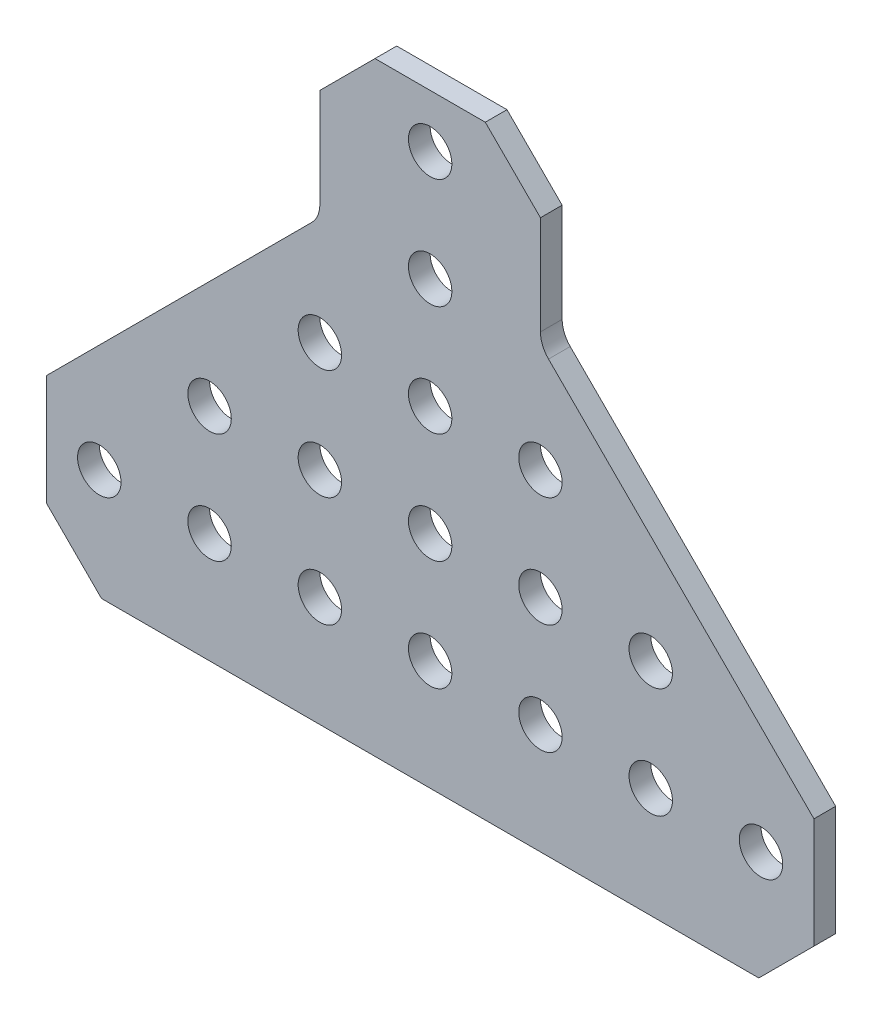
ISO-10303-21;
HEADER;
FILE_DESCRIPTION(('STEP AP214'),'2;1');
FILE_NAME('part.step','',(''),(''),'','','');
FILE_SCHEMA(('AUTOMOTIVE_DESIGN { 1 0 10303 214 1 1 1 1 }'));
ENDSEC;
DATA;
#1=APPLICATION_CONTEXT('core data for automotive mechanical design processes');
#2=APPLICATION_PROTOCOL_DEFINITION('international standard','automotive_design',2000,#1);
#3=PRODUCT_CONTEXT('',#1,'mechanical');
#4=PRODUCT('Part','Part','',(#3));
#5=PRODUCT_RELATED_PRODUCT_CATEGORY('part','',(#4));
#6=PRODUCT_DEFINITION_FORMATION('','',#4);
#7=PRODUCT_DEFINITION_CONTEXT('part definition',#1,'design');
#8=PRODUCT_DEFINITION('design','',#6,#7);
#9=PRODUCT_DEFINITION_SHAPE('','',#8);
#10=(LENGTH_UNIT() NAMED_UNIT(*) SI_UNIT(.MILLI.,.METRE.));
#11=(NAMED_UNIT(*) PLANE_ANGLE_UNIT() SI_UNIT($,.RADIAN.));
#12=(NAMED_UNIT(*) SI_UNIT($,.STERADIAN.) SOLID_ANGLE_UNIT());
#13=UNCERTAINTY_MEASURE_WITH_UNIT(LENGTH_MEASURE(1.E-05),#10,'distance_accuracy_value','');
#14=(GEOMETRIC_REPRESENTATION_CONTEXT(3) GLOBAL_UNCERTAINTY_ASSIGNED_CONTEXT((#13)) GLOBAL_UNIT_ASSIGNED_CONTEXT((#10,
#11,#12)) REPRESENTATION_CONTEXT('',''));
#15=CARTESIAN_POINT('',(0.,0.,0.));
#16=DIRECTION('',(0.,0.,1.));
#17=DIRECTION('',(1.,0.,0.));
#18=AXIS2_PLACEMENT_3D('',#15,#16,#17);
#19=CARTESIAN_POINT('',(-44.196,-6.35,1.25));
#20=DIRECTION('',(-1.,0.,0.));
#21=DIRECTION('',(0.,-1.,0.));
#22=AXIS2_PLACEMENT_3D('',#19,#20,#21);
#23=PLANE('',#22);
#24=DIRECTION('',(0.,1.,0.));
#25=VECTOR('',#24,1.);
#26=CARTESIAN_POINT('',(-44.196,-6.35,-1.25));
#27=LINE('',#26,#25);
#28=CARTESIAN_POINT('',(-44.196,-6.35,-1.25));
#29=VERTEX_POINT('',#28);
#30=CARTESIAN_POINT('',(-44.1960000000002,6.35000000000021,-1.25));
#31=VERTEX_POINT('',#30);
#32=EDGE_CURVE('E172',#29,#31,#27,.T.);
#33=ORIENTED_EDGE('',*,*,#32,.F.);
#34=DIRECTION('',(0.,0.,-1.));
#35=VECTOR('',#34,1.);
#36=CARTESIAN_POINT('',(-44.196,-6.35,1.25));
#37=LINE('',#36,#35);
#38=CARTESIAN_POINT('',(-44.196,-6.35,1.25));
#39=VERTEX_POINT('',#38);
#40=EDGE_CURVE('E11',#39,#29,#37,.T.);
#41=ORIENTED_EDGE('',*,*,#40,.F.);
#42=DIRECTION('',(0.,1.,0.));
#43=VECTOR('',#42,1.);
#44=CARTESIAN_POINT('',(-44.196,-6.35,1.25));
#45=LINE('',#44,#43);
#46=CARTESIAN_POINT('',(-44.1960000000002,6.35000000000021,1.25));
#47=VERTEX_POINT('',#46);
#48=EDGE_CURVE('E211',#39,#47,#45,.T.);
#49=ORIENTED_EDGE('',*,*,#48,.T.);
#50=DIRECTION('',(0.,0.,-1.));
#51=VECTOR('',#50,1.);
#52=CARTESIAN_POINT('',(-44.1960000000002,6.35000000000021,1.25));
#53=LINE('',#52,#51);
#54=EDGE_CURVE('E42',#47,#31,#53,.T.);
#55=ORIENTED_EDGE('',*,*,#54,.T.);
#56=EDGE_LOOP('',(#33,#41,#49,#55));
#57=FACE_BOUND('',#56,.T.);
#58=ADVANCED_FACE('F39',(#57),#23,.T.);
#59=CARTESIAN_POINT('',(-37.846,-12.7,1.25));
#60=DIRECTION('',(-0.707106781186547,-0.707106781186548,0.));
#61=DIRECTION('',(0.707106781186548,-0.707106781186547,0.));
#62=AXIS2_PLACEMENT_3D('',#59,#60,#61);
#63=PLANE('',#62);
#64=DIRECTION('',(-0.707106781186548,0.707106781186547,0.));
#65=VECTOR('',#64,1.);
#66=CARTESIAN_POINT('',(-37.846,-12.7,-1.25));
#67=LINE('',#66,#65);
#68=CARTESIAN_POINT('',(-37.846,-12.7,-1.25));
#69=VERTEX_POINT('',#68);
#70=EDGE_CURVE('E209',#69,#29,#67,.T.);
#71=ORIENTED_EDGE('',*,*,#70,.F.);
#72=DIRECTION('',(0.,0.,-1.));
#73=VECTOR('',#72,1.);
#74=CARTESIAN_POINT('',(-37.846,-12.7,1.25));
#75=LINE('',#74,#73);
#76=CARTESIAN_POINT('',(-37.846,-12.7,1.25));
#77=VERTEX_POINT('',#76);
#78=EDGE_CURVE('E48',#77,#69,#75,.T.);
#79=ORIENTED_EDGE('',*,*,#78,.F.);
#80=DIRECTION('',(-0.707106781186548,0.707106781186547,0.));
#81=VECTOR('',#80,1.);
#82=CARTESIAN_POINT('',(-37.846,-12.7,1.25));
#83=LINE('',#82,#81);
#84=EDGE_CURVE('E162',#77,#39,#83,.T.);
#85=ORIENTED_EDGE('',*,*,#84,.T.);
#86=ORIENTED_EDGE('',*,*,#40,.T.);
#87=EDGE_LOOP('',(#71,#79,#85,#86));
#88=FACE_BOUND('',#87,.T.);
#89=ADVANCED_FACE('F235',(#88),#63,.T.);
#90=CARTESIAN_POINT('',(37.846,-12.7,1.25));
#91=DIRECTION('',(0.,-1.,0.));
#92=DIRECTION('',(0.,0.,-1.));
#93=AXIS2_PLACEMENT_3D('',#90,#91,#92);
#94=PLANE('',#93);
#95=DIRECTION('',(-1.,0.,0.));
#96=VECTOR('',#95,1.);
#97=CARTESIAN_POINT('',(37.846,-12.7,-1.25));
#98=LINE('',#97,#96);
#99=CARTESIAN_POINT('',(37.846,-12.7,-1.25));
#100=VERTEX_POINT('',#99);
#101=EDGE_CURVE('E149',#100,#69,#98,.T.);
#102=ORIENTED_EDGE('',*,*,#101,.F.);
#103=DIRECTION('',(0.,0.,-1.));
#104=VECTOR('',#103,1.);
#105=CARTESIAN_POINT('',(37.846,-12.7,1.25));
#106=LINE('',#105,#104);
#107=CARTESIAN_POINT('',(37.846,-12.7,1.25));
#108=VERTEX_POINT('',#107);
#109=EDGE_CURVE('E144',#108,#100,#106,.T.);
#110=ORIENTED_EDGE('',*,*,#109,.F.);
#111=DIRECTION('',(-1.,0.,0.));
#112=VECTOR('',#111,1.);
#113=CARTESIAN_POINT('',(37.846,-12.7,1.25));
#114=LINE('',#113,#112);
#115=EDGE_CURVE('E147',#108,#77,#114,.T.);
#116=ORIENTED_EDGE('',*,*,#115,.T.);
#117=ORIENTED_EDGE('',*,*,#78,.T.);
#118=EDGE_LOOP('',(#102,#110,#116,#117));
#119=FACE_BOUND('',#118,.T.);
#120=ADVANCED_FACE('F146',(#119),#94,.T.);
#121=CARTESIAN_POINT('',(44.196,-6.35,1.25));
#122=DIRECTION('',(0.707106781186547,-0.707106781186548,0.));
#123=DIRECTION('',(0.707106781186548,0.707106781186547,0.));
#124=AXIS2_PLACEMENT_3D('',#121,#122,#123);
#125=PLANE('',#124);
#126=DIRECTION('',(-0.707106781186548,-0.707106781186547,0.));
#127=VECTOR('',#126,1.);
#128=CARTESIAN_POINT('',(44.196,-6.35,-1.25));
#129=LINE('',#128,#127);
#130=CARTESIAN_POINT('',(44.196,-6.35,-1.25));
#131=VERTEX_POINT('',#130);
#132=EDGE_CURVE('E206',#131,#100,#129,.T.);
#133=ORIENTED_EDGE('',*,*,#132,.F.);
#134=DIRECTION('',(0.,0.,-1.));
#135=VECTOR('',#134,1.);
#136=CARTESIAN_POINT('',(44.196,-6.35,1.25));
#137=LINE('',#136,#135);
#138=CARTESIAN_POINT('',(44.196,-6.35,1.25));
#139=VERTEX_POINT('',#138);
#140=EDGE_CURVE('E154',#139,#131,#137,.T.);
#141=ORIENTED_EDGE('',*,*,#140,.F.);
#142=DIRECTION('',(-0.707106781186548,-0.707106781186547,0.));
#143=VECTOR('',#142,1.);
#144=CARTESIAN_POINT('',(44.196,-6.35,1.25));
#145=LINE('',#144,#143);
#146=EDGE_CURVE('E160',#139,#108,#145,.T.);
#147=ORIENTED_EDGE('',*,*,#146,.T.);
#148=ORIENTED_EDGE('',*,*,#109,.T.);
#149=EDGE_LOOP('',(#133,#141,#147,#148));
#150=FACE_BOUND('',#149,.T.);
#151=ADVANCED_FACE('F164',(#150),#125,.T.);
#152=CARTESIAN_POINT('',(44.196,6.35,1.25));
#153=DIRECTION('',(1.,0.,0.));
#154=DIRECTION('',(0.,0.,-1.));
#155=AXIS2_PLACEMENT_3D('',#152,#153,#154);
#156=PLANE('',#155);
#157=DIRECTION('',(0.,-1.,0.));
#158=VECTOR('',#157,1.);
#159=CARTESIAN_POINT('',(44.196,6.35,-1.25));
#160=LINE('',#159,#158);
#161=CARTESIAN_POINT('',(44.196,6.35,-1.25));
#162=VERTEX_POINT('',#161);
#163=EDGE_CURVE('E203',#162,#131,#160,.T.);
#164=ORIENTED_EDGE('',*,*,#163,.F.);
#165=DIRECTION('',(0.,0.,-1.));
#166=VECTOR('',#165,1.);
#167=CARTESIAN_POINT('',(44.196,6.35,1.25));
#168=LINE('',#167,#166);
#169=CARTESIAN_POINT('',(44.196,6.35,1.25));
#170=VERTEX_POINT('',#169);
#171=EDGE_CURVE('E215',#170,#162,#168,.T.);
#172=ORIENTED_EDGE('',*,*,#171,.F.);
#173=DIRECTION('',(0.,-1.,0.));
#174=VECTOR('',#173,1.);
#175=CARTESIAN_POINT('',(44.196,6.35,1.25));
#176=LINE('',#175,#174);
#177=EDGE_CURVE('E165',#170,#139,#176,.T.);
#178=ORIENTED_EDGE('',*,*,#177,.T.);
#179=ORIENTED_EDGE('',*,*,#140,.T.);
#180=EDGE_LOOP('',(#164,#172,#178,#179));
#181=FACE_BOUND('',#180,.T.);
#182=ADVANCED_FACE('F248',(#181),#156,.T.);
#183=CARTESIAN_POINT('',(13.6299359697327,36.9160640302674,1.25));
#184=DIRECTION('',(0.707106781186549,0.707106781186546,0.));
#185=DIRECTION('',(-0.707106781186546,0.707106781186549,0.));
#186=AXIS2_PLACEMENT_3D('',#183,#184,#185);
#187=PLANE('',#186);
#188=DIRECTION('',(0.707106781186546,-0.707106781186549,0.));
#189=VECTOR('',#188,1.);
#190=CARTESIAN_POINT('',(13.6299359697327,36.9160640302674,-1.25));
#191=LINE('',#190,#189);
#192=CARTESIAN_POINT('',(13.6299359697327,36.9160640302674,-1.25));
#193=VERTEX_POINT('',#192);
#194=EDGE_CURVE('E200',#193,#162,#191,.T.);
#195=ORIENTED_EDGE('',*,*,#194,.F.);
#196=DIRECTION('',(0.,0.,-1.));
#197=VECTOR('',#196,1.);
#198=CARTESIAN_POINT('',(13.6299359697327,36.9160640302674,1.25));
#199=LINE('',#198,#197);
#200=CARTESIAN_POINT('',(13.6299359697327,36.9160640302674,1.25));
#201=VERTEX_POINT('',#200);
#202=EDGE_CURVE('E217',#201,#193,#199,.T.);
#203=ORIENTED_EDGE('',*,*,#202,.F.);
#204=DIRECTION('',(0.707106781186546,-0.707106781186549,0.));
#205=VECTOR('',#204,1.);
#206=CARTESIAN_POINT('',(13.6299359697327,36.9160640302674,1.25));
#207=LINE('',#206,#205);
#208=EDGE_CURVE('E167',#201,#170,#207,.T.);
#209=ORIENTED_EDGE('',*,*,#208,.T.);
#210=ORIENTED_EDGE('',*,*,#171,.T.);
#211=EDGE_LOOP('',(#195,#203,#209,#210));
#212=FACE_BOUND('',#211,.T.);
#213=ADVANCED_FACE('F251',(#212),#187,.T.);
#214=CARTESIAN_POINT('',(15.875,39.1611280605347,1.25));
#215=DIRECTION('',(0.,0.,-1.));
#216=DIRECTION('',(-1.,0.,0.));
#217=AXIS2_PLACEMENT_3D('',#214,#215,#216);
#218=CYLINDRICAL_SURFACE('',#217,3.17500000000001);
#219=CARTESIAN_POINT('',(15.875,39.1611280605347,-1.25));
#220=DIRECTION('',(0.,0.,1.));
#221=DIRECTION('',(1.,0.,0.));
#222=AXIS2_PLACEMENT_3D('',#219,#220,#221);
#223=CIRCLE('',#222,3.17500000000001);
#224=CARTESIAN_POINT('',(12.7,39.1611280605347,-1.25));
#225=VERTEX_POINT('',#224);
#226=EDGE_CURVE('E197',#225,#193,#223,.T.);
#227=ORIENTED_EDGE('',*,*,#226,.F.);
#228=DIRECTION('',(0.,0.,-1.));
#229=VECTOR('',#228,1.);
#230=CARTESIAN_POINT('',(12.7,39.1611280605347,1.25));
#231=LINE('',#230,#229);
#232=CARTESIAN_POINT('',(12.7,39.1611280605347,1.25));
#233=VERTEX_POINT('',#232);
#234=EDGE_CURVE('E219',#233,#225,#231,.T.);
#235=ORIENTED_EDGE('',*,*,#234,.F.);
#236=CARTESIAN_POINT('',(15.875,39.1611280605347,1.25));
#237=DIRECTION('',(0.,0.,1.));
#238=DIRECTION('',(1.,0.,0.));
#239=AXIS2_PLACEMENT_3D('',#236,#237,#238);
#240=CIRCLE('',#239,3.17500000000001);
#241=EDGE_CURVE('E489',#233,#201,#240,.T.);
#242=ORIENTED_EDGE('',*,*,#241,.T.);
#243=ORIENTED_EDGE('',*,*,#202,.T.);
#244=EDGE_LOOP('',(#227,#235,#242,#243));
#245=FACE_BOUND('',#244,.T.);
#246=ADVANCED_FACE('F255',(#245),#218,.F.);
#247=CARTESIAN_POINT('',(12.7,50.546,1.25));
#248=DIRECTION('',(1.,0.,0.));
#249=DIRECTION('',(0.,0.,-1.));
#250=AXIS2_PLACEMENT_3D('',#247,#248,#249);
#251=PLANE('',#250);
#252=DIRECTION('',(0.,-1.,0.));
#253=VECTOR('',#252,1.);
#254=CARTESIAN_POINT('',(12.7,50.546,-1.25));
#255=LINE('',#254,#253);
#256=CARTESIAN_POINT('',(12.7,50.546,-1.25));
#257=VERTEX_POINT('',#256);
#258=EDGE_CURVE('E194',#257,#225,#255,.T.);
#259=ORIENTED_EDGE('',*,*,#258,.F.);
#260=DIRECTION('',(0.,0.,-1.));
#261=VECTOR('',#260,1.);
#262=CARTESIAN_POINT('',(12.7,50.546,1.25));
#263=LINE('',#262,#261);
#264=CARTESIAN_POINT('',(12.7,50.546,1.25));
#265=VERTEX_POINT('',#264);
#266=EDGE_CURVE('E221',#265,#257,#263,.T.);
#267=ORIENTED_EDGE('',*,*,#266,.F.);
#268=DIRECTION('',(0.,-1.,0.));
#269=VECTOR('',#268,1.);
#270=CARTESIAN_POINT('',(12.7,50.546,1.25));
#271=LINE('',#270,#269);
#272=EDGE_CURVE('E486',#265,#233,#271,.T.);
#273=ORIENTED_EDGE('',*,*,#272,.T.);
#274=ORIENTED_EDGE('',*,*,#234,.T.);
#275=EDGE_LOOP('',(#259,#267,#273,#274));
#276=FACE_BOUND('',#275,.T.);
#277=ADVANCED_FACE('F259',(#276),#251,.T.);
#278=CARTESIAN_POINT('',(6.35,56.896,1.25));
#279=DIRECTION('',(0.707106781186548,0.707106781186547,0.));
#280=DIRECTION('',(-0.707106781186547,0.707106781186548,0.));
#281=AXIS2_PLACEMENT_3D('',#278,#279,#280);
#282=PLANE('',#281);
#283=DIRECTION('',(0.707106781186547,-0.707106781186548,0.));
#284=VECTOR('',#283,1.);
#285=CARTESIAN_POINT('',(6.35,56.896,-1.25));
#286=LINE('',#285,#284);
#287=CARTESIAN_POINT('',(6.35,56.896,-1.25));
#288=VERTEX_POINT('',#287);
#289=EDGE_CURVE('E191',#288,#257,#286,.T.);
#290=ORIENTED_EDGE('',*,*,#289,.F.);
#291=DIRECTION('',(0.,0.,-1.));
#292=VECTOR('',#291,1.);
#293=CARTESIAN_POINT('',(6.35,56.896,1.25));
#294=LINE('',#293,#292);
#295=CARTESIAN_POINT('',(6.35,56.896,1.25));
#296=VERTEX_POINT('',#295);
#297=EDGE_CURVE('E223',#296,#288,#294,.T.);
#298=ORIENTED_EDGE('',*,*,#297,.F.);
#299=DIRECTION('',(0.707106781186547,-0.707106781186548,0.));
#300=VECTOR('',#299,1.);
#301=CARTESIAN_POINT('',(6.35,56.896,1.25));
#302=LINE('',#301,#300);
#303=EDGE_CURVE('E483',#296,#265,#302,.T.);
#304=ORIENTED_EDGE('',*,*,#303,.T.);
#305=ORIENTED_EDGE('',*,*,#266,.T.);
#306=EDGE_LOOP('',(#290,#298,#304,#305));
#307=FACE_BOUND('',#306,.T.);
#308=ADVANCED_FACE('F263',(#307),#282,.T.);
#309=CARTESIAN_POINT('',(-6.35,56.896,1.25));
#310=DIRECTION('',(0.,1.,0.));
#311=DIRECTION('',(0.,0.,1.));
#312=AXIS2_PLACEMENT_3D('',#309,#310,#311);
#313=PLANE('',#312);
#314=DIRECTION('',(1.,0.,0.));
#315=VECTOR('',#314,1.);
#316=CARTESIAN_POINT('',(-6.35,56.896,-1.25));
#317=LINE('',#316,#315);
#318=CARTESIAN_POINT('',(-6.35,56.896,-1.25));
#319=VERTEX_POINT('',#318);
#320=EDGE_CURVE('E188',#319,#288,#317,.T.);
#321=ORIENTED_EDGE('',*,*,#320,.F.);
#322=DIRECTION('',(0.,0.,-1.));
#323=VECTOR('',#322,1.);
#324=CARTESIAN_POINT('',(-6.35,56.896,1.25));
#325=LINE('',#324,#323);
#326=CARTESIAN_POINT('',(-6.35,56.896,1.25));
#327=VERTEX_POINT('',#326);
#328=EDGE_CURVE('E225',#327,#319,#325,.T.);
#329=ORIENTED_EDGE('',*,*,#328,.F.);
#330=DIRECTION('',(1.,0.,0.));
#331=VECTOR('',#330,1.);
#332=CARTESIAN_POINT('',(-6.35,56.896,1.25));
#333=LINE('',#332,#331);
#334=EDGE_CURVE('E480',#327,#296,#333,.T.);
#335=ORIENTED_EDGE('',*,*,#334,.T.);
#336=ORIENTED_EDGE('',*,*,#297,.T.);
#337=EDGE_LOOP('',(#321,#329,#335,#336));
#338=FACE_BOUND('',#337,.T.);
#339=ADVANCED_FACE('F267',(#338),#313,.T.);
#340=CARTESIAN_POINT('',(-12.7,50.546,1.25));
#341=DIRECTION('',(-0.707106781186548,0.707106781186547,0.));
#342=DIRECTION('',(-0.707106781186547,-0.707106781186548,0.));
#343=AXIS2_PLACEMENT_3D('',#340,#341,#342);
#344=PLANE('',#343);
#345=DIRECTION('',(0.707106781186547,0.707106781186548,0.));
#346=VECTOR('',#345,1.);
#347=CARTESIAN_POINT('',(-12.7,50.546,-1.25));
#348=LINE('',#347,#346);
#349=CARTESIAN_POINT('',(-12.7,50.546,-1.25));
#350=VERTEX_POINT('',#349);
#351=EDGE_CURVE('E185',#350,#319,#348,.T.);
#352=ORIENTED_EDGE('',*,*,#351,.F.);
#353=DIRECTION('',(0.,0.,-1.));
#354=VECTOR('',#353,1.);
#355=CARTESIAN_POINT('',(-12.7,50.546,1.25));
#356=LINE('',#355,#354);
#357=CARTESIAN_POINT('',(-12.7,50.546,1.25));
#358=VERTEX_POINT('',#357);
#359=EDGE_CURVE('E227',#358,#350,#356,.T.);
#360=ORIENTED_EDGE('',*,*,#359,.F.);
#361=DIRECTION('',(0.707106781186547,0.707106781186548,0.));
#362=VECTOR('',#361,1.);
#363=CARTESIAN_POINT('',(-12.7,50.546,1.25));
#364=LINE('',#363,#362);
#365=EDGE_CURVE('E477',#358,#327,#364,.T.);
#366=ORIENTED_EDGE('',*,*,#365,.T.);
#367=ORIENTED_EDGE('',*,*,#328,.T.);
#368=EDGE_LOOP('',(#352,#360,#366,#367));
#369=FACE_BOUND('',#368,.T.);
#370=ADVANCED_FACE('F271',(#369),#344,.T.);
#371=CARTESIAN_POINT('',(-12.7,39.1611280605344,1.25));
#372=DIRECTION('',(-1.,0.,0.));
#373=DIRECTION('',(0.,0.,1.));
#374=AXIS2_PLACEMENT_3D('',#371,#372,#373);
#375=PLANE('',#374);
#376=DIRECTION('',(0.,1.,0.));
#377=VECTOR('',#376,1.);
#378=CARTESIAN_POINT('',(-12.7,39.1611280605344,-1.25));
#379=LINE('',#378,#377);
#380=CARTESIAN_POINT('',(-12.7,39.1611280605344,-1.25));
#381=VERTEX_POINT('',#380);
#382=EDGE_CURVE('E182',#381,#350,#379,.T.);
#383=ORIENTED_EDGE('',*,*,#382,.F.);
#384=DIRECTION('',(0.,0.,-1.));
#385=VECTOR('',#384,1.);
#386=CARTESIAN_POINT('',(-12.7,39.1611280605344,1.25));
#387=LINE('',#386,#385);
#388=CARTESIAN_POINT('',(-12.7,39.1611280605344,1.25));
#389=VERTEX_POINT('',#388);
#390=EDGE_CURVE('E229',#389,#381,#387,.T.);
#391=ORIENTED_EDGE('',*,*,#390,.F.);
#392=DIRECTION('',(0.,1.,0.));
#393=VECTOR('',#392,1.);
#394=CARTESIAN_POINT('',(-12.7,39.1611280605344,1.25));
#395=LINE('',#394,#393);
#396=EDGE_CURVE('E474',#389,#358,#395,.T.);
#397=ORIENTED_EDGE('',*,*,#396,.T.);
#398=ORIENTED_EDGE('',*,*,#359,.T.);
#399=EDGE_LOOP('',(#383,#391,#397,#398));
#400=FACE_BOUND('',#399,.T.);
#401=ADVANCED_FACE('F275',(#400),#375,.T.);
#402=CARTESIAN_POINT('',(-15.875,39.1611280605344,1.25));
#403=DIRECTION('',(0.,0.,-1.));
#404=DIRECTION('',(-1.,0.,0.));
#405=AXIS2_PLACEMENT_3D('',#402,#403,#404);
#406=CYLINDRICAL_SURFACE('',#405,3.17500000000001);
#407=CARTESIAN_POINT('',(-15.875,39.1611280605344,-1.25));
#408=DIRECTION('',(0.,0.,1.));
#409=DIRECTION('',(1.,0.,0.));
#410=AXIS2_PLACEMENT_3D('',#407,#408,#409);
#411=CIRCLE('',#410,3.17500000000001);
#412=CARTESIAN_POINT('',(-13.6299359697327,36.9160640302671,-1.25));
#413=VERTEX_POINT('',#412);
#414=EDGE_CURVE('E179',#413,#381,#411,.T.);
#415=ORIENTED_EDGE('',*,*,#414,.F.);
#416=DIRECTION('',(0.,0.,-1.));
#417=VECTOR('',#416,1.);
#418=CARTESIAN_POINT('',(-13.6299359697327,36.9160640302671,1.25));
#419=LINE('',#418,#417);
#420=CARTESIAN_POINT('',(-13.6299359697327,36.9160640302671,1.25));
#421=VERTEX_POINT('',#420);
#422=EDGE_CURVE('E230',#421,#413,#419,.T.);
#423=ORIENTED_EDGE('',*,*,#422,.F.);
#424=CARTESIAN_POINT('',(-15.875,39.1611280605344,1.25));
#425=DIRECTION('',(0.,0.,1.));
#426=DIRECTION('',(1.,0.,0.));
#427=AXIS2_PLACEMENT_3D('',#424,#425,#426);
#428=CIRCLE('',#427,3.17500000000001);
#429=EDGE_CURVE('E471',#421,#389,#428,.T.);
#430=ORIENTED_EDGE('',*,*,#429,.T.);
#431=ORIENTED_EDGE('',*,*,#390,.T.);
#432=EDGE_LOOP('',(#415,#423,#430,#431));
#433=FACE_BOUND('',#432,.T.);
#434=ADVANCED_FACE('F279',(#433),#406,.F.);
#435=CARTESIAN_POINT('',(-44.1960000000002,6.35000000000021,1.25));
#436=DIRECTION('',(-0.70710678118654,0.707106781186555,0.));
#437=DIRECTION('',(-0.707106781186555,-0.70710678118654,0.));
#438=AXIS2_PLACEMENT_3D('',#435,#436,#437);
#439=PLANE('',#438);
#440=DIRECTION('',(0.707106781186555,0.70710678118654,0.));
#441=VECTOR('',#440,1.);
#442=CARTESIAN_POINT('',(-44.1960000000002,6.35000000000021,-1.25));
#443=LINE('',#442,#441);
#444=EDGE_CURVE('E175',#31,#413,#443,.T.);
#445=ORIENTED_EDGE('',*,*,#444,.F.);
#446=ORIENTED_EDGE('',*,*,#54,.F.);
#447=DIRECTION('',(0.707106781186555,0.70710678118654,0.));
#448=VECTOR('',#447,1.);
#449=CARTESIAN_POINT('',(-44.1960000000002,6.35000000000021,1.25));
#450=LINE('',#449,#448);
#451=EDGE_CURVE('E469',#47,#421,#450,.T.);
#452=ORIENTED_EDGE('',*,*,#451,.T.);
#453=ORIENTED_EDGE('',*,*,#422,.T.);
#454=EDGE_LOOP('',(#445,#446,#452,#453));
#455=FACE_BOUND('',#454,.T.);
#456=ADVANCED_FACE('F232',(#455),#439,.T.);
#457=CARTESIAN_POINT('',(-15.875,39.1611280605344,1.25));
#458=DIRECTION('',(0.,0.,1.));
#459=DIRECTION('',(1.,0.,0.));
#460=AXIS2_PLACEMENT_3D('',#457,#458,#459);
#461=PLANE('',#460);
#462=CARTESIAN_POINT('',(25.4,12.7,1.25));
#463=DIRECTION('',(0.,0.,-1.));
#464=DIRECTION('',(1.,0.,0.));
#465=AXIS2_PLACEMENT_3D('',#462,#463,#464);
#466=CIRCLE('',#465,2.5);
#467=CARTESIAN_POINT('',(27.9,12.7,1.25));
#468=VERTEX_POINT('',#467);
#469=EDGE_CURVE('E366',#468,#468,#466,.T.);
#470=ORIENTED_EDGE('',*,*,#469,.T.);
#471=EDGE_LOOP('',(#470));
#472=FACE_BOUND('',#471,.T.);
#473=CARTESIAN_POINT('',(12.7,25.4,1.25));
#474=DIRECTION('',(0.,0.,-1.));
#475=DIRECTION('',(1.,0.,0.));
#476=AXIS2_PLACEMENT_3D('',#473,#474,#475);
#477=CIRCLE('',#476,2.5);
#478=CARTESIAN_POINT('',(15.2,25.4,1.25));
#479=VERTEX_POINT('',#478);
#480=EDGE_CURVE('E374',#479,#479,#477,.T.);
#481=ORIENTED_EDGE('',*,*,#480,.T.);
#482=EDGE_LOOP('',(#481));
#483=FACE_BOUND('',#482,.T.);
#484=CARTESIAN_POINT('',(12.7,12.7,1.25));
#485=DIRECTION('',(0.,0.,-1.));
#486=DIRECTION('',(1.,0.,0.));
#487=AXIS2_PLACEMENT_3D('',#484,#485,#486);
#488=CIRCLE('',#487,2.5);
#489=CARTESIAN_POINT('',(15.2,12.7,1.25));
#490=VERTEX_POINT('',#489);
#491=EDGE_CURVE('E380',#490,#490,#488,.T.);
#492=ORIENTED_EDGE('',*,*,#491,.T.);
#493=EDGE_LOOP('',(#492));
#494=FACE_BOUND('',#493,.T.);
#495=CARTESIAN_POINT('',(-12.7,25.4,1.25));
#496=DIRECTION('',(0.,0.,-1.));
#497=DIRECTION('',(1.,0.,0.));
#498=AXIS2_PLACEMENT_3D('',#495,#496,#497);
#499=CIRCLE('',#498,2.5);
#500=CARTESIAN_POINT('',(-10.2,25.4,1.25));
#501=VERTEX_POINT('',#500);
#502=EDGE_CURVE('E386',#501,#501,#499,.T.);
#503=ORIENTED_EDGE('',*,*,#502,.T.);
#504=EDGE_LOOP('',(#503));
#505=FACE_BOUND('',#504,.T.);
#506=CARTESIAN_POINT('',(-12.7,12.7,1.25));
#507=DIRECTION('',(0.,0.,-1.));
#508=DIRECTION('',(1.,0.,0.));
#509=AXIS2_PLACEMENT_3D('',#506,#507,#508);
#510=CIRCLE('',#509,2.5);
#511=CARTESIAN_POINT('',(-10.2,12.7,1.25));
#512=VERTEX_POINT('',#511);
#513=EDGE_CURVE('E392',#512,#512,#510,.T.);
#514=ORIENTED_EDGE('',*,*,#513,.T.);
#515=EDGE_LOOP('',(#514));
#516=FACE_BOUND('',#515,.T.);
#517=CARTESIAN_POINT('',(-25.4,12.7,1.25));
#518=DIRECTION('',(0.,0.,-1.));
#519=DIRECTION('',(1.,0.,0.));
#520=AXIS2_PLACEMENT_3D('',#517,#518,#519);
#521=CIRCLE('',#520,2.5);
#522=CARTESIAN_POINT('',(-22.9,12.7,1.25));
#523=VERTEX_POINT('',#522);
#524=EDGE_CURVE('E398',#523,#523,#521,.T.);
#525=ORIENTED_EDGE('',*,*,#524,.T.);
#526=EDGE_LOOP('',(#525));
#527=FACE_BOUND('',#526,.T.);
#528=CARTESIAN_POINT('',(0.,25.4,1.25));
#529=DIRECTION('',(0.,0.,-1.));
#530=DIRECTION('',(1.,0.,0.));
#531=AXIS2_PLACEMENT_3D('',#528,#529,#530);
#532=CIRCLE('',#531,2.5);
#533=CARTESIAN_POINT('',(2.5,25.4,1.25));
#534=VERTEX_POINT('',#533);
#535=EDGE_CURVE('E404',#534,#534,#532,.T.);
#536=ORIENTED_EDGE('',*,*,#535,.T.);
#537=EDGE_LOOP('',(#536));
#538=FACE_BOUND('',#537,.T.);
#539=CARTESIAN_POINT('',(0.,12.7,1.25));
#540=DIRECTION('',(0.,0.,-1.));
#541=DIRECTION('',(1.,0.,0.));
#542=AXIS2_PLACEMENT_3D('',#539,#540,#541);
#543=CIRCLE('',#542,2.5);
#544=CARTESIAN_POINT('',(2.5,12.7,1.25));
#545=VERTEX_POINT('',#544);
#546=EDGE_CURVE('E410',#545,#545,#543,.T.);
#547=ORIENTED_EDGE('',*,*,#546,.T.);
#548=EDGE_LOOP('',(#547));
#549=FACE_BOUND('',#548,.T.);
#550=CARTESIAN_POINT('',(-25.4,0.,1.25));
#551=DIRECTION('',(0.,0.,-1.));
#552=DIRECTION('',(1.,0.,0.));
#553=AXIS2_PLACEMENT_3D('',#550,#551,#552);
#554=CIRCLE('',#553,2.5);
#555=CARTESIAN_POINT('',(-22.9,0.,1.25));
#556=VERTEX_POINT('',#555);
#557=EDGE_CURVE('E416',#556,#556,#554,.T.);
#558=ORIENTED_EDGE('',*,*,#557,.T.);
#559=EDGE_LOOP('',(#558));
#560=FACE_BOUND('',#559,.T.);
#561=CARTESIAN_POINT('',(-38.1,0.,1.25));
#562=DIRECTION('',(0.,0.,-1.));
#563=DIRECTION('',(1.,0.,0.));
#564=AXIS2_PLACEMENT_3D('',#561,#562,#563);
#565=CIRCLE('',#564,2.5);
#566=CARTESIAN_POINT('',(-35.6,0.,1.25));
#567=VERTEX_POINT('',#566);
#568=EDGE_CURVE('E422',#567,#567,#565,.T.);
#569=ORIENTED_EDGE('',*,*,#568,.T.);
#570=EDGE_LOOP('',(#569));
#571=FACE_BOUND('',#570,.T.);
#572=CARTESIAN_POINT('',(-12.7,0.,1.25));
#573=DIRECTION('',(0.,0.,-1.));
#574=DIRECTION('',(1.,0.,0.));
#575=AXIS2_PLACEMENT_3D('',#572,#573,#574);
#576=CIRCLE('',#575,2.5);
#577=CARTESIAN_POINT('',(-10.2,0.,1.25));
#578=VERTEX_POINT('',#577);
#579=EDGE_CURVE('E428',#578,#578,#576,.T.);
#580=ORIENTED_EDGE('',*,*,#579,.T.);
#581=EDGE_LOOP('',(#580));
#582=FACE_BOUND('',#581,.T.);
#583=CARTESIAN_POINT('',(0.,0.,1.25));
#584=DIRECTION('',(0.,0.,-1.));
#585=DIRECTION('',(1.,0.,0.));
#586=AXIS2_PLACEMENT_3D('',#583,#584,#585);
#587=CIRCLE('',#586,2.5);
#588=CARTESIAN_POINT('',(2.49999999999999,0.,1.25));
#589=VERTEX_POINT('',#588);
#590=EDGE_CURVE('E434',#589,#589,#587,.T.);
#591=ORIENTED_EDGE('',*,*,#590,.T.);
#592=EDGE_LOOP('',(#591));
#593=FACE_BOUND('',#592,.T.);
#594=CARTESIAN_POINT('',(12.7,0.,1.25));
#595=DIRECTION('',(0.,0.,-1.));
#596=DIRECTION('',(1.,0.,0.));
#597=AXIS2_PLACEMENT_3D('',#594,#595,#596);
#598=CIRCLE('',#597,2.5);
#599=CARTESIAN_POINT('',(15.2,0.,1.25));
#600=VERTEX_POINT('',#599);
#601=EDGE_CURVE('E440',#600,#600,#598,.T.);
#602=ORIENTED_EDGE('',*,*,#601,.T.);
#603=EDGE_LOOP('',(#602));
#604=FACE_BOUND('',#603,.T.);
#605=CARTESIAN_POINT('',(25.4,0.,1.25));
#606=DIRECTION('',(0.,0.,-1.));
#607=DIRECTION('',(1.,0.,0.));
#608=AXIS2_PLACEMENT_3D('',#605,#606,#607);
#609=CIRCLE('',#608,2.5);
#610=CARTESIAN_POINT('',(27.9,0.,1.25));
#611=VERTEX_POINT('',#610);
#612=EDGE_CURVE('E446',#611,#611,#609,.T.);
#613=ORIENTED_EDGE('',*,*,#612,.T.);
#614=EDGE_LOOP('',(#613));
#615=FACE_BOUND('',#614,.T.);
#616=CARTESIAN_POINT('',(38.1,0.,1.25));
#617=DIRECTION('',(0.,0.,-1.));
#618=DIRECTION('',(1.,0.,0.));
#619=AXIS2_PLACEMENT_3D('',#616,#617,#618);
#620=CIRCLE('',#619,2.5);
#621=CARTESIAN_POINT('',(40.6,0.,1.25));
#622=VERTEX_POINT('',#621);
#623=EDGE_CURVE('E452',#622,#622,#620,.T.);
#624=ORIENTED_EDGE('',*,*,#623,.T.);
#625=EDGE_LOOP('',(#624));
#626=FACE_BOUND('',#625,.T.);
#627=CARTESIAN_POINT('',(0.,38.1,1.25));
#628=DIRECTION('',(0.,0.,-1.));
#629=DIRECTION('',(1.,0.,0.));
#630=AXIS2_PLACEMENT_3D('',#627,#628,#629);
#631=CIRCLE('',#630,2.5);
#632=CARTESIAN_POINT('',(2.5,38.1,1.25));
#633=VERTEX_POINT('',#632);
#634=EDGE_CURVE('E458',#633,#633,#631,.T.);
#635=ORIENTED_EDGE('',*,*,#634,.T.);
#636=EDGE_LOOP('',(#635));
#637=FACE_BOUND('',#636,.T.);
#638=CARTESIAN_POINT('',(0.,50.8,1.25));
#639=DIRECTION('',(0.,0.,-1.));
#640=DIRECTION('',(1.,0.,0.));
#641=AXIS2_PLACEMENT_3D('',#638,#639,#640);
#642=CIRCLE('',#641,2.5);
#643=CARTESIAN_POINT('',(2.5,50.8,1.25));
#644=VERTEX_POINT('',#643);
#645=EDGE_CURVE('E176',#644,#644,#642,.T.);
#646=ORIENTED_EDGE('',*,*,#645,.T.);
#647=EDGE_LOOP('',(#646));
#648=FACE_BOUND('',#647,.T.);
#649=ORIENTED_EDGE('',*,*,#48,.F.);
#650=ORIENTED_EDGE('',*,*,#84,.F.);
#651=ORIENTED_EDGE('',*,*,#115,.F.);
#652=ORIENTED_EDGE('',*,*,#146,.F.);
#653=ORIENTED_EDGE('',*,*,#177,.F.);
#654=ORIENTED_EDGE('',*,*,#208,.F.);
#655=ORIENTED_EDGE('',*,*,#241,.F.);
#656=ORIENTED_EDGE('',*,*,#272,.F.);
#657=ORIENTED_EDGE('',*,*,#303,.F.);
#658=ORIENTED_EDGE('',*,*,#334,.F.);
#659=ORIENTED_EDGE('',*,*,#365,.F.);
#660=ORIENTED_EDGE('',*,*,#396,.F.);
#661=ORIENTED_EDGE('',*,*,#429,.F.);
#662=ORIENTED_EDGE('',*,*,#451,.F.);
#663=EDGE_LOOP('',(#649,#650,#651,#652,#653,#654,#655,#656,#657,#658,#659,#660,#661,#662));
#664=FACE_BOUND('',#663,.T.);
#665=ADVANCED_FACE('F158',(#472,#483,#494,#505,#516,#527,#538,#549,#560,#571,#582,#593,#604,
#615,#626,#637,#648,#664),#461,.T.);
#666=CARTESIAN_POINT('',(-15.875,39.1611280605344,-1.25));
#667=DIRECTION('',(0.,0.,1.));
#668=DIRECTION('',(1.,0.,0.));
#669=AXIS2_PLACEMENT_3D('',#666,#667,#668);
#670=PLANE('',#669);
#671=CARTESIAN_POINT('',(25.4,12.7,-1.25));
#672=DIRECTION('',(0.,0.,-1.));
#673=DIRECTION('',(1.,0.,0.));
#674=AXIS2_PLACEMENT_3D('',#671,#672,#673);
#675=CIRCLE('',#674,2.5);
#676=CARTESIAN_POINT('',(27.9,12.7,-1.25));
#677=VERTEX_POINT('',#676);
#678=EDGE_CURVE('E369',#677,#677,#675,.T.);
#679=ORIENTED_EDGE('',*,*,#678,.F.);
#680=EDGE_LOOP('',(#679));
#681=FACE_BOUND('',#680,.T.);
#682=CARTESIAN_POINT('',(12.7,25.4,-1.25));
#683=DIRECTION('',(0.,0.,-1.));
#684=DIRECTION('',(1.,0.,0.));
#685=AXIS2_PLACEMENT_3D('',#682,#683,#684);
#686=CIRCLE('',#685,2.5);
#687=CARTESIAN_POINT('',(15.2,25.4,-1.25));
#688=VERTEX_POINT('',#687);
#689=EDGE_CURVE('E371',#688,#688,#686,.T.);
#690=ORIENTED_EDGE('',*,*,#689,.F.);
#691=EDGE_LOOP('',(#690));
#692=FACE_BOUND('',#691,.T.);
#693=CARTESIAN_POINT('',(12.7,12.7,-1.25));
#694=DIRECTION('',(0.,0.,-1.));
#695=DIRECTION('',(1.,0.,0.));
#696=AXIS2_PLACEMENT_3D('',#693,#694,#695);
#697=CIRCLE('',#696,2.5);
#698=CARTESIAN_POINT('',(15.2,12.7,-1.25));
#699=VERTEX_POINT('',#698);
#700=EDGE_CURVE('E377',#699,#699,#697,.T.);
#701=ORIENTED_EDGE('',*,*,#700,.F.);
#702=EDGE_LOOP('',(#701));
#703=FACE_BOUND('',#702,.T.);
#704=CARTESIAN_POINT('',(-12.7,25.4,-1.25));
#705=DIRECTION('',(0.,0.,-1.));
#706=DIRECTION('',(1.,0.,0.));
#707=AXIS2_PLACEMENT_3D('',#704,#705,#706);
#708=CIRCLE('',#707,2.5);
#709=CARTESIAN_POINT('',(-10.2,25.4,-1.25));
#710=VERTEX_POINT('',#709);
#711=EDGE_CURVE('E383',#710,#710,#708,.T.);
#712=ORIENTED_EDGE('',*,*,#711,.F.);
#713=EDGE_LOOP('',(#712));
#714=FACE_BOUND('',#713,.T.);
#715=CARTESIAN_POINT('',(-12.7,12.7,-1.25));
#716=DIRECTION('',(0.,0.,-1.));
#717=DIRECTION('',(1.,0.,0.));
#718=AXIS2_PLACEMENT_3D('',#715,#716,#717);
#719=CIRCLE('',#718,2.5);
#720=CARTESIAN_POINT('',(-10.2,12.7,-1.25));
#721=VERTEX_POINT('',#720);
#722=EDGE_CURVE('E389',#721,#721,#719,.T.);
#723=ORIENTED_EDGE('',*,*,#722,.F.);
#724=EDGE_LOOP('',(#723));
#725=FACE_BOUND('',#724,.T.);
#726=CARTESIAN_POINT('',(-25.4,12.7,-1.25));
#727=DIRECTION('',(0.,0.,-1.));
#728=DIRECTION('',(1.,0.,0.));
#729=AXIS2_PLACEMENT_3D('',#726,#727,#728);
#730=CIRCLE('',#729,2.5);
#731=CARTESIAN_POINT('',(-22.9,12.7,-1.25));
#732=VERTEX_POINT('',#731);
#733=EDGE_CURVE('E395',#732,#732,#730,.T.);
#734=ORIENTED_EDGE('',*,*,#733,.F.);
#735=EDGE_LOOP('',(#734));
#736=FACE_BOUND('',#735,.T.);
#737=CARTESIAN_POINT('',(0.,25.4,-1.25));
#738=DIRECTION('',(0.,0.,-1.));
#739=DIRECTION('',(1.,0.,0.));
#740=AXIS2_PLACEMENT_3D('',#737,#738,#739);
#741=CIRCLE('',#740,2.5);
#742=CARTESIAN_POINT('',(2.5,25.4,-1.25));
#743=VERTEX_POINT('',#742);
#744=EDGE_CURVE('E401',#743,#743,#741,.T.);
#745=ORIENTED_EDGE('',*,*,#744,.F.);
#746=EDGE_LOOP('',(#745));
#747=FACE_BOUND('',#746,.T.);
#748=CARTESIAN_POINT('',(0.,12.7,-1.25));
#749=DIRECTION('',(0.,0.,-1.));
#750=DIRECTION('',(1.,0.,0.));
#751=AXIS2_PLACEMENT_3D('',#748,#749,#750);
#752=CIRCLE('',#751,2.5);
#753=CARTESIAN_POINT('',(2.5,12.7,-1.25));
#754=VERTEX_POINT('',#753);
#755=EDGE_CURVE('E407',#754,#754,#752,.T.);
#756=ORIENTED_EDGE('',*,*,#755,.F.);
#757=EDGE_LOOP('',(#756));
#758=FACE_BOUND('',#757,.T.);
#759=CARTESIAN_POINT('',(-25.4,0.,-1.25));
#760=DIRECTION('',(0.,0.,-1.));
#761=DIRECTION('',(1.,0.,0.));
#762=AXIS2_PLACEMENT_3D('',#759,#760,#761);
#763=CIRCLE('',#762,2.5);
#764=CARTESIAN_POINT('',(-22.9,0.,-1.25));
#765=VERTEX_POINT('',#764);
#766=EDGE_CURVE('E413',#765,#765,#763,.T.);
#767=ORIENTED_EDGE('',*,*,#766,.F.);
#768=EDGE_LOOP('',(#767));
#769=FACE_BOUND('',#768,.T.);
#770=CARTESIAN_POINT('',(-38.1,0.,-1.25));
#771=DIRECTION('',(0.,0.,-1.));
#772=DIRECTION('',(1.,0.,0.));
#773=AXIS2_PLACEMENT_3D('',#770,#771,#772);
#774=CIRCLE('',#773,2.5);
#775=CARTESIAN_POINT('',(-35.6,0.,-1.25));
#776=VERTEX_POINT('',#775);
#777=EDGE_CURVE('E419',#776,#776,#774,.T.);
#778=ORIENTED_EDGE('',*,*,#777,.F.);
#779=EDGE_LOOP('',(#778));
#780=FACE_BOUND('',#779,.T.);
#781=CARTESIAN_POINT('',(-12.7,0.,-1.25));
#782=DIRECTION('',(0.,0.,-1.));
#783=DIRECTION('',(1.,0.,0.));
#784=AXIS2_PLACEMENT_3D('',#781,#782,#783);
#785=CIRCLE('',#784,2.5);
#786=CARTESIAN_POINT('',(-10.2,0.,-1.25));
#787=VERTEX_POINT('',#786);
#788=EDGE_CURVE('E425',#787,#787,#785,.T.);
#789=ORIENTED_EDGE('',*,*,#788,.F.);
#790=EDGE_LOOP('',(#789));
#791=FACE_BOUND('',#790,.T.);
#792=CARTESIAN_POINT('',(0.,0.,-1.25));
#793=DIRECTION('',(0.,0.,-1.));
#794=DIRECTION('',(1.,0.,0.));
#795=AXIS2_PLACEMENT_3D('',#792,#793,#794);
#796=CIRCLE('',#795,2.5);
#797=CARTESIAN_POINT('',(2.49999999999999,0.,-1.25));
#798=VERTEX_POINT('',#797);
#799=EDGE_CURVE('E431',#798,#798,#796,.T.);
#800=ORIENTED_EDGE('',*,*,#799,.F.);
#801=EDGE_LOOP('',(#800));
#802=FACE_BOUND('',#801,.T.);
#803=CARTESIAN_POINT('',(12.7,0.,-1.25));
#804=DIRECTION('',(0.,0.,-1.));
#805=DIRECTION('',(1.,0.,0.));
#806=AXIS2_PLACEMENT_3D('',#803,#804,#805);
#807=CIRCLE('',#806,2.5);
#808=CARTESIAN_POINT('',(15.2,0.,-1.25));
#809=VERTEX_POINT('',#808);
#810=EDGE_CURVE('E437',#809,#809,#807,.T.);
#811=ORIENTED_EDGE('',*,*,#810,.F.);
#812=EDGE_LOOP('',(#811));
#813=FACE_BOUND('',#812,.T.);
#814=CARTESIAN_POINT('',(25.4,0.,-1.25));
#815=DIRECTION('',(0.,0.,-1.));
#816=DIRECTION('',(1.,0.,0.));
#817=AXIS2_PLACEMENT_3D('',#814,#815,#816);
#818=CIRCLE('',#817,2.5);
#819=CARTESIAN_POINT('',(27.9,0.,-1.25));
#820=VERTEX_POINT('',#819);
#821=EDGE_CURVE('E443',#820,#820,#818,.T.);
#822=ORIENTED_EDGE('',*,*,#821,.F.);
#823=EDGE_LOOP('',(#822));
#824=FACE_BOUND('',#823,.T.);
#825=CARTESIAN_POINT('',(38.1,0.,-1.25));
#826=DIRECTION('',(0.,0.,-1.));
#827=DIRECTION('',(1.,0.,0.));
#828=AXIS2_PLACEMENT_3D('',#825,#826,#827);
#829=CIRCLE('',#828,2.5);
#830=CARTESIAN_POINT('',(40.6,0.,-1.25));
#831=VERTEX_POINT('',#830);
#832=EDGE_CURVE('E449',#831,#831,#829,.T.);
#833=ORIENTED_EDGE('',*,*,#832,.F.);
#834=EDGE_LOOP('',(#833));
#835=FACE_BOUND('',#834,.T.);
#836=CARTESIAN_POINT('',(0.,38.1,-1.25));
#837=DIRECTION('',(0.,0.,-1.));
#838=DIRECTION('',(1.,0.,0.));
#839=AXIS2_PLACEMENT_3D('',#836,#837,#838);
#840=CIRCLE('',#839,2.5);
#841=CARTESIAN_POINT('',(2.5,38.1,-1.25));
#842=VERTEX_POINT('',#841);
#843=EDGE_CURVE('E455',#842,#842,#840,.T.);
#844=ORIENTED_EDGE('',*,*,#843,.F.);
#845=EDGE_LOOP('',(#844));
#846=FACE_BOUND('',#845,.T.);
#847=CARTESIAN_POINT('',(0.,50.8,-1.25));
#848=DIRECTION('',(0.,0.,-1.));
#849=DIRECTION('',(1.,0.,0.));
#850=AXIS2_PLACEMENT_3D('',#847,#848,#849);
#851=CIRCLE('',#850,2.5);
#852=CARTESIAN_POINT('',(2.5,50.8,-1.25));
#853=VERTEX_POINT('',#852);
#854=EDGE_CURVE('E461',#853,#853,#851,.T.);
#855=ORIENTED_EDGE('',*,*,#854,.F.);
#856=EDGE_LOOP('',(#855));
#857=FACE_BOUND('',#856,.T.);
#858=ORIENTED_EDGE('',*,*,#32,.T.);
#859=ORIENTED_EDGE('',*,*,#444,.T.);
#860=ORIENTED_EDGE('',*,*,#414,.T.);
#861=ORIENTED_EDGE('',*,*,#382,.T.);
#862=ORIENTED_EDGE('',*,*,#351,.T.);
#863=ORIENTED_EDGE('',*,*,#320,.T.);
#864=ORIENTED_EDGE('',*,*,#289,.T.);
#865=ORIENTED_EDGE('',*,*,#258,.T.);
#866=ORIENTED_EDGE('',*,*,#226,.T.);
#867=ORIENTED_EDGE('',*,*,#194,.T.);
#868=ORIENTED_EDGE('',*,*,#163,.T.);
#869=ORIENTED_EDGE('',*,*,#132,.T.);
#870=ORIENTED_EDGE('',*,*,#101,.T.);
#871=ORIENTED_EDGE('',*,*,#70,.T.);
#872=EDGE_LOOP('',(#858,#859,#860,#861,#862,#863,#864,#865,#866,#867,#868,#869,#870,#871));
#873=FACE_BOUND('',#872,.T.);
#874=ADVANCED_FACE('F234',(#681,#692,#703,#714,#725,#736,#747,#758,#769,#780,#791,#802,#813,
#824,#835,#846,#857,#873),#670,.F.);
#875=CARTESIAN_POINT('',(0.,50.8,1.25));
#876=DIRECTION('',(0.,0.,-1.));
#877=DIRECTION('',(-1.,0.,0.));
#878=AXIS2_PLACEMENT_3D('',#875,#876,#877);
#879=CYLINDRICAL_SURFACE('',#878,2.5);
#880=ORIENTED_EDGE('',*,*,#645,.F.);
#881=EDGE_LOOP('',(#880));
#882=FACE_BOUND('',#881,.T.);
#883=ORIENTED_EDGE('',*,*,#854,.T.);
#884=EDGE_LOOP('',(#883));
#885=FACE_BOUND('',#884,.T.);
#886=ADVANCED_FACE('F291',(#882,#885),#879,.F.);
#887=CARTESIAN_POINT('',(0.,38.1,1.25));
#888=DIRECTION('',(0.,0.,-1.));
#889=DIRECTION('',(-1.,0.,0.));
#890=AXIS2_PLACEMENT_3D('',#887,#888,#889);
#891=CYLINDRICAL_SURFACE('',#890,2.5);
#892=ORIENTED_EDGE('',*,*,#634,.F.);
#893=EDGE_LOOP('',(#892));
#894=FACE_BOUND('',#893,.T.);
#895=ORIENTED_EDGE('',*,*,#843,.T.);
#896=EDGE_LOOP('',(#895));
#897=FACE_BOUND('',#896,.T.);
#898=ADVANCED_FACE('F298',(#894,#897),#891,.F.);
#899=CARTESIAN_POINT('',(38.1,0.,1.25));
#900=DIRECTION('',(0.,0.,-1.));
#901=DIRECTION('',(-1.,0.,0.));
#902=AXIS2_PLACEMENT_3D('',#899,#900,#901);
#903=CYLINDRICAL_SURFACE('',#902,2.5);
#904=ORIENTED_EDGE('',*,*,#623,.F.);
#905=EDGE_LOOP('',(#904));
#906=FACE_BOUND('',#905,.T.);
#907=ORIENTED_EDGE('',*,*,#832,.T.);
#908=EDGE_LOOP('',(#907));
#909=FACE_BOUND('',#908,.T.);
#910=ADVANCED_FACE('F302',(#906,#909),#903,.F.);
#911=CARTESIAN_POINT('',(25.4,0.,1.25));
#912=DIRECTION('',(0.,0.,-1.));
#913=DIRECTION('',(-1.,0.,0.));
#914=AXIS2_PLACEMENT_3D('',#911,#912,#913);
#915=CYLINDRICAL_SURFACE('',#914,2.5);
#916=ORIENTED_EDGE('',*,*,#612,.F.);
#917=EDGE_LOOP('',(#916));
#918=FACE_BOUND('',#917,.T.);
#919=ORIENTED_EDGE('',*,*,#821,.T.);
#920=EDGE_LOOP('',(#919));
#921=FACE_BOUND('',#920,.T.);
#922=ADVANCED_FACE('F306',(#918,#921),#915,.F.);
#923=CARTESIAN_POINT('',(12.7,0.,1.25));
#924=DIRECTION('',(0.,0.,-1.));
#925=DIRECTION('',(-1.,0.,0.));
#926=AXIS2_PLACEMENT_3D('',#923,#924,#925);
#927=CYLINDRICAL_SURFACE('',#926,2.5);
#928=ORIENTED_EDGE('',*,*,#601,.F.);
#929=EDGE_LOOP('',(#928));
#930=FACE_BOUND('',#929,.T.);
#931=ORIENTED_EDGE('',*,*,#810,.T.);
#932=EDGE_LOOP('',(#931));
#933=FACE_BOUND('',#932,.T.);
#934=ADVANCED_FACE('F310',(#930,#933),#927,.F.);
#935=CARTESIAN_POINT('',(0.,0.,1.25));
#936=DIRECTION('',(0.,0.,-1.));
#937=DIRECTION('',(-1.,0.,0.));
#938=AXIS2_PLACEMENT_3D('',#935,#936,#937);
#939=CYLINDRICAL_SURFACE('',#938,2.5);
#940=ORIENTED_EDGE('',*,*,#590,.F.);
#941=EDGE_LOOP('',(#940));
#942=FACE_BOUND('',#941,.T.);
#943=ORIENTED_EDGE('',*,*,#799,.T.);
#944=EDGE_LOOP('',(#943));
#945=FACE_BOUND('',#944,.T.);
#946=ADVANCED_FACE('F314',(#942,#945),#939,.F.);
#947=CARTESIAN_POINT('',(-12.7,0.,1.25));
#948=DIRECTION('',(0.,0.,-1.));
#949=DIRECTION('',(-1.,0.,0.));
#950=AXIS2_PLACEMENT_3D('',#947,#948,#949);
#951=CYLINDRICAL_SURFACE('',#950,2.5);
#952=ORIENTED_EDGE('',*,*,#579,.F.);
#953=EDGE_LOOP('',(#952));
#954=FACE_BOUND('',#953,.T.);
#955=ORIENTED_EDGE('',*,*,#788,.T.);
#956=EDGE_LOOP('',(#955));
#957=FACE_BOUND('',#956,.T.);
#958=ADVANCED_FACE('F318',(#954,#957),#951,.F.);
#959=CARTESIAN_POINT('',(-38.1,0.,1.25));
#960=DIRECTION('',(0.,0.,-1.));
#961=DIRECTION('',(-1.,0.,0.));
#962=AXIS2_PLACEMENT_3D('',#959,#960,#961);
#963=CYLINDRICAL_SURFACE('',#962,2.5);
#964=ORIENTED_EDGE('',*,*,#568,.F.);
#965=EDGE_LOOP('',(#964));
#966=FACE_BOUND('',#965,.T.);
#967=ORIENTED_EDGE('',*,*,#777,.T.);
#968=EDGE_LOOP('',(#967));
#969=FACE_BOUND('',#968,.T.);
#970=ADVANCED_FACE('F322',(#966,#969),#963,.F.);
#971=CARTESIAN_POINT('',(-25.4,0.,1.25));
#972=DIRECTION('',(0.,0.,-1.));
#973=DIRECTION('',(-1.,0.,0.));
#974=AXIS2_PLACEMENT_3D('',#971,#972,#973);
#975=CYLINDRICAL_SURFACE('',#974,2.5);
#976=ORIENTED_EDGE('',*,*,#557,.F.);
#977=EDGE_LOOP('',(#976));
#978=FACE_BOUND('',#977,.T.);
#979=ORIENTED_EDGE('',*,*,#766,.T.);
#980=EDGE_LOOP('',(#979));
#981=FACE_BOUND('',#980,.T.);
#982=ADVANCED_FACE('F326',(#978,#981),#975,.F.);
#983=CARTESIAN_POINT('',(0.,12.7,1.25));
#984=DIRECTION('',(0.,0.,-1.));
#985=DIRECTION('',(-1.,0.,0.));
#986=AXIS2_PLACEMENT_3D('',#983,#984,#985);
#987=CYLINDRICAL_SURFACE('',#986,2.5);
#988=ORIENTED_EDGE('',*,*,#546,.F.);
#989=EDGE_LOOP('',(#988));
#990=FACE_BOUND('',#989,.T.);
#991=ORIENTED_EDGE('',*,*,#755,.T.);
#992=EDGE_LOOP('',(#991));
#993=FACE_BOUND('',#992,.T.);
#994=ADVANCED_FACE('F330',(#990,#993),#987,.F.);
#995=CARTESIAN_POINT('',(0.,25.4,1.25));
#996=DIRECTION('',(0.,0.,-1.));
#997=DIRECTION('',(-1.,0.,0.));
#998=AXIS2_PLACEMENT_3D('',#995,#996,#997);
#999=CYLINDRICAL_SURFACE('',#998,2.5);
#1000=ORIENTED_EDGE('',*,*,#535,.F.);
#1001=EDGE_LOOP('',(#1000));
#1002=FACE_BOUND('',#1001,.T.);
#1003=ORIENTED_EDGE('',*,*,#744,.T.);
#1004=EDGE_LOOP('',(#1003));
#1005=FACE_BOUND('',#1004,.T.);
#1006=ADVANCED_FACE('F334',(#1002,#1005),#999,.F.);
#1007=CARTESIAN_POINT('',(-25.4,12.7,1.25));
#1008=DIRECTION('',(0.,0.,-1.));
#1009=DIRECTION('',(-1.,0.,0.));
#1010=AXIS2_PLACEMENT_3D('',#1007,#1008,#1009);
#1011=CYLINDRICAL_SURFACE('',#1010,2.5);
#1012=ORIENTED_EDGE('',*,*,#524,.F.);
#1013=EDGE_LOOP('',(#1012));
#1014=FACE_BOUND('',#1013,.T.);
#1015=ORIENTED_EDGE('',*,*,#733,.T.);
#1016=EDGE_LOOP('',(#1015));
#1017=FACE_BOUND('',#1016,.T.);
#1018=ADVANCED_FACE('F338',(#1014,#1017),#1011,.F.);
#1019=CARTESIAN_POINT('',(-12.7,12.7,1.25));
#1020=DIRECTION('',(0.,0.,-1.));
#1021=DIRECTION('',(-1.,0.,0.));
#1022=AXIS2_PLACEMENT_3D('',#1019,#1020,#1021);
#1023=CYLINDRICAL_SURFACE('',#1022,2.5);
#1024=ORIENTED_EDGE('',*,*,#513,.F.);
#1025=EDGE_LOOP('',(#1024));
#1026=FACE_BOUND('',#1025,.T.);
#1027=ORIENTED_EDGE('',*,*,#722,.T.);
#1028=EDGE_LOOP('',(#1027));
#1029=FACE_BOUND('',#1028,.T.);
#1030=ADVANCED_FACE('F342',(#1026,#1029),#1023,.F.);
#1031=CARTESIAN_POINT('',(-12.7,25.4,1.25));
#1032=DIRECTION('',(0.,0.,-1.));
#1033=DIRECTION('',(-1.,0.,0.));
#1034=AXIS2_PLACEMENT_3D('',#1031,#1032,#1033);
#1035=CYLINDRICAL_SURFACE('',#1034,2.5);
#1036=ORIENTED_EDGE('',*,*,#502,.F.);
#1037=EDGE_LOOP('',(#1036));
#1038=FACE_BOUND('',#1037,.T.);
#1039=ORIENTED_EDGE('',*,*,#711,.T.);
#1040=EDGE_LOOP('',(#1039));
#1041=FACE_BOUND('',#1040,.T.);
#1042=ADVANCED_FACE('F346',(#1038,#1041),#1035,.F.);
#1043=CARTESIAN_POINT('',(12.7,12.7,1.25));
#1044=DIRECTION('',(0.,0.,-1.));
#1045=DIRECTION('',(-1.,0.,0.));
#1046=AXIS2_PLACEMENT_3D('',#1043,#1044,#1045);
#1047=CYLINDRICAL_SURFACE('',#1046,2.5);
#1048=ORIENTED_EDGE('',*,*,#491,.F.);
#1049=EDGE_LOOP('',(#1048));
#1050=FACE_BOUND('',#1049,.T.);
#1051=ORIENTED_EDGE('',*,*,#700,.T.);
#1052=EDGE_LOOP('',(#1051));
#1053=FACE_BOUND('',#1052,.T.);
#1054=ADVANCED_FACE('F350',(#1050,#1053),#1047,.F.);
#1055=CARTESIAN_POINT('',(12.7,25.4,1.25));
#1056=DIRECTION('',(0.,0.,-1.));
#1057=DIRECTION('',(-1.,0.,0.));
#1058=AXIS2_PLACEMENT_3D('',#1055,#1056,#1057);
#1059=CYLINDRICAL_SURFACE('',#1058,2.5);
#1060=ORIENTED_EDGE('',*,*,#480,.F.);
#1061=EDGE_LOOP('',(#1060));
#1062=FACE_BOUND('',#1061,.T.);
#1063=ORIENTED_EDGE('',*,*,#689,.T.);
#1064=EDGE_LOOP('',(#1063));
#1065=FACE_BOUND('',#1064,.T.);
#1066=ADVANCED_FACE('F354',(#1062,#1065),#1059,.F.);
#1067=CARTESIAN_POINT('',(25.4,12.7,1.25));
#1068=DIRECTION('',(0.,0.,-1.));
#1069=DIRECTION('',(-1.,0.,0.));
#1070=AXIS2_PLACEMENT_3D('',#1067,#1068,#1069);
#1071=CYLINDRICAL_SURFACE('',#1070,2.5);
#1072=ORIENTED_EDGE('',*,*,#469,.F.);
#1073=EDGE_LOOP('',(#1072));
#1074=FACE_BOUND('',#1073,.T.);
#1075=ORIENTED_EDGE('',*,*,#678,.T.);
#1076=EDGE_LOOP('',(#1075));
#1077=FACE_BOUND('',#1076,.T.);
#1078=ADVANCED_FACE('F358',(#1074,#1077),#1071,.F.);
#1079=CLOSED_SHELL('',(#58,#89,#120,#151,#182,#213,#246,#277,#308,#339,#370,#401,#434,#456,#665,
#874,#886,#898,#910,#922,#934,#946,#958,#970,#982,#994,#1006,#1018,#1030,#1042,#1054,#1066,#1078));
#1080=MANIFOLD_SOLID_BREP('B2',#1079);
#1081=ADVANCED_BREP_SHAPE_REPRESENTATION('',(#18,#1080),#14);
#1082=SHAPE_DEFINITION_REPRESENTATION(#9,#1081);
ENDSEC;
END-ISO-10303-21;
